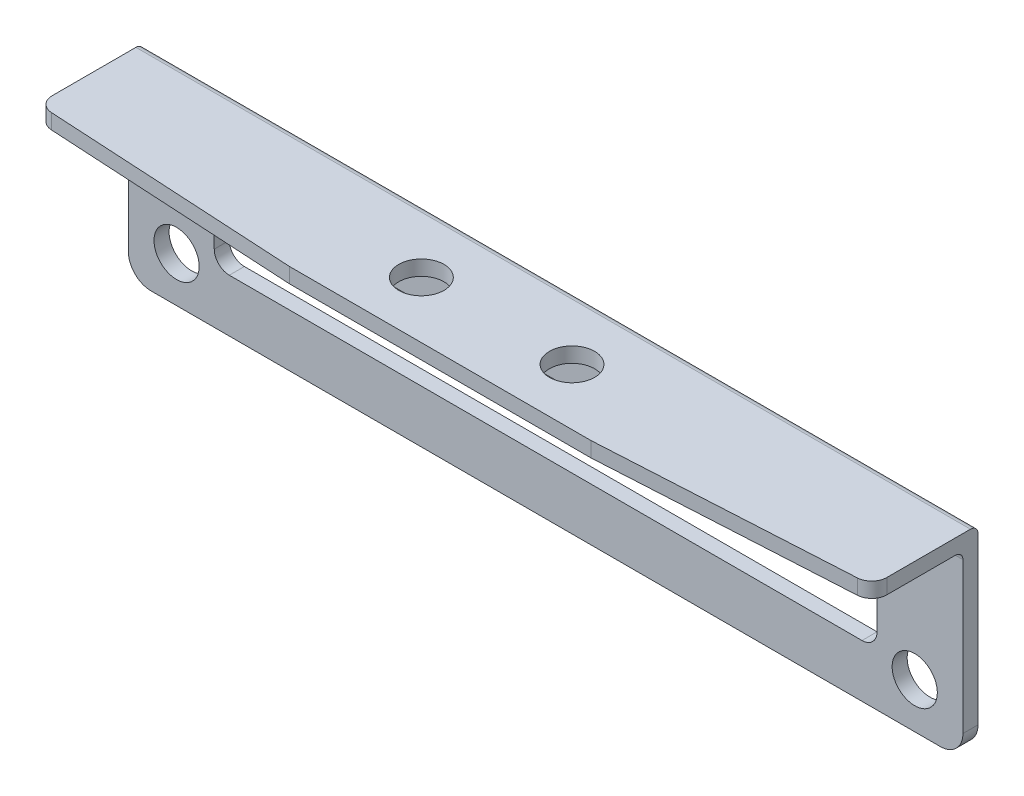
ISO-10303-21;
HEADER;
FILE_DESCRIPTION(('STEP AP214'),'2;1');
FILE_NAME('part.step','',(''),(''),'','','');
FILE_SCHEMA(('AUTOMOTIVE_DESIGN { 1 0 10303 214 1 1 1 1 }'));
ENDSEC;
DATA;
#1=APPLICATION_CONTEXT('core data for automotive mechanical design processes');
#2=APPLICATION_PROTOCOL_DEFINITION('international standard','automotive_design',2000,#1);
#3=PRODUCT_CONTEXT('',#1,'mechanical');
#4=PRODUCT('Part','Part','',(#3));
#5=PRODUCT_RELATED_PRODUCT_CATEGORY('part','',(#4));
#6=PRODUCT_DEFINITION_FORMATION('','',#4);
#7=PRODUCT_DEFINITION_CONTEXT('part definition',#1,'design');
#8=PRODUCT_DEFINITION('design','',#6,#7);
#9=PRODUCT_DEFINITION_SHAPE('','',#8);
#10=(LENGTH_UNIT() NAMED_UNIT(*) SI_UNIT(.MILLI.,.METRE.));
#11=(NAMED_UNIT(*) PLANE_ANGLE_UNIT() SI_UNIT($,.RADIAN.));
#12=(NAMED_UNIT(*) SI_UNIT($,.STERADIAN.) SOLID_ANGLE_UNIT());
#13=UNCERTAINTY_MEASURE_WITH_UNIT(LENGTH_MEASURE(1.E-05),#10,'distance_accuracy_value','');
#14=(GEOMETRIC_REPRESENTATION_CONTEXT(3) GLOBAL_UNCERTAINTY_ASSIGNED_CONTEXT((#13)) GLOBAL_UNIT_ASSIGNED_CONTEXT((#10,
#11,#12)) REPRESENTATION_CONTEXT('',''));
#15=CARTESIAN_POINT('',(0.,0.,0.));
#16=DIRECTION('',(0.,0.,1.));
#17=DIRECTION('',(1.,0.,0.));
#18=AXIS2_PLACEMENT_3D('',#15,#16,#17);
#19=CARTESIAN_POINT('',(0.,0.,1.));
#20=DIRECTION('',(0.,0.,1.));
#21=DIRECTION('',(1.,0.,0.));
#22=AXIS2_PLACEMENT_3D('',#19,#20,#21);
#23=PLANE('',#22);
#24=DIRECTION('',(1.,0.,0.));
#25=VECTOR('',#24,1.);
#26=CARTESIAN_POINT('',(-27.7,0.,1.));
#27=LINE('',#26,#25);
#28=CARTESIAN_POINT('',(-26.2,0.,1.));
#29=VERTEX_POINT('',#28);
#30=CARTESIAN_POINT('',(26.2,0.,1.));
#31=VERTEX_POINT('',#30);
#32=EDGE_CURVE('E252',#29,#31,#27,.T.);
#33=ORIENTED_EDGE('',*,*,#32,.T.);
#34=CARTESIAN_POINT('',(26.2,1.5,1.));
#35=DIRECTION('',(0.,0.,1.));
#36=DIRECTION('',(1.,0.,0.));
#37=AXIS2_PLACEMENT_3D('',#34,#35,#36);
#38=CIRCLE('',#37,1.5);
#39=CARTESIAN_POINT('',(27.7,1.5,1.));
#40=VERTEX_POINT('',#39);
#41=EDGE_CURVE('E367',#31,#40,#38,.T.);
#42=ORIENTED_EDGE('',*,*,#41,.T.);
#43=DIRECTION('',(0.,1.,0.));
#44=VECTOR('',#43,1.);
#45=CARTESIAN_POINT('',(27.7,0.,1.));
#46=LINE('',#45,#44);
#47=CARTESIAN_POINT('',(27.7,11.5,1.));
#48=VERTEX_POINT('',#47);
#49=EDGE_CURVE('E318',#40,#48,#46,.T.);
#50=ORIENTED_EDGE('',*,*,#49,.T.);
#51=DIRECTION('',(1.,0.,0.));
#52=VECTOR('',#51,1.);
#53=CARTESIAN_POINT('',(0.,11.5,1.));
#54=LINE('',#53,#52);
#55=CARTESIAN_POINT('',(-27.7,11.5,1.));
#56=VERTEX_POINT('',#55);
#57=EDGE_CURVE('E273',#48,#56,#54,.F.);
#58=ORIENTED_EDGE('',*,*,#57,.T.);
#59=DIRECTION('',(0.,-1.,0.));
#60=VECTOR('',#59,1.);
#61=CARTESIAN_POINT('',(-27.7,13.,1.));
#62=LINE('',#61,#60);
#63=CARTESIAN_POINT('',(-27.7,1.5,1.));
#64=VERTEX_POINT('',#63);
#65=EDGE_CURVE('E255',#56,#64,#62,.T.);
#66=ORIENTED_EDGE('',*,*,#65,.T.);
#67=CARTESIAN_POINT('',(-26.2,1.5,1.));
#68=DIRECTION('',(0.,0.,1.));
#69=DIRECTION('',(1.,0.,0.));
#70=AXIS2_PLACEMENT_3D('',#67,#68,#69);
#71=CIRCLE('',#70,1.5);
#72=EDGE_CURVE('E380',#64,#29,#71,.T.);
#73=ORIENTED_EDGE('',*,*,#72,.T.);
#74=EDGE_LOOP('',(#33,#42,#50,#58,#66,#73));
#75=FACE_BOUND('',#74,.T.);
#76=CARTESIAN_POINT('',(-24.5,3.,1.));
#77=DIRECTION('',(0.,0.,1.));
#78=DIRECTION('',(1.,0.,0.));
#79=AXIS2_PLACEMENT_3D('',#76,#77,#78);
#80=CIRCLE('',#79,1.5);
#81=CARTESIAN_POINT('',(-23.,3.,1.));
#82=VERTEX_POINT('',#81);
#83=EDGE_CURVE('E220',#82,#82,#80,.T.);
#84=ORIENTED_EDGE('',*,*,#83,.F.);
#85=EDGE_LOOP('',(#84));
#86=FACE_BOUND('',#85,.T.);
#87=DIRECTION('',(-1.,0.,0.));
#88=VECTOR('',#87,1.);
#89=CARTESIAN_POINT('',(-22.,8.3,1.));
#90=LINE('',#89,#88);
#91=CARTESIAN_POINT('',(21.,8.3,1.));
#92=VERTEX_POINT('',#91);
#93=CARTESIAN_POINT('',(-21.,8.3,1.));
#94=VERTEX_POINT('',#93);
#95=EDGE_CURVE('E229',#92,#94,#90,.T.);
#96=ORIENTED_EDGE('',*,*,#95,.F.);
#97=CARTESIAN_POINT('',(21.,7.3,1.));
#98=DIRECTION('',(0.,0.,1.));
#99=DIRECTION('',(1.,0.,0.));
#100=AXIS2_PLACEMENT_3D('',#97,#98,#99);
#101=CIRCLE('',#100,1.);
#102=CARTESIAN_POINT('',(22.,7.3,1.));
#103=VERTEX_POINT('',#102);
#104=EDGE_CURVE('E307',#92,#103,#101,.F.);
#105=ORIENTED_EDGE('',*,*,#104,.T.);
#106=DIRECTION('',(0.,1.,0.));
#107=VECTOR('',#106,1.);
#108=CARTESIAN_POINT('',(22.,8.3,1.));
#109=LINE('',#108,#107);
#110=CARTESIAN_POINT('',(22.,4.5,1.));
#111=VERTEX_POINT('',#110);
#112=EDGE_CURVE('E226',#111,#103,#109,.T.);
#113=ORIENTED_EDGE('',*,*,#112,.F.);
#114=CARTESIAN_POINT('',(21.,4.5,1.));
#115=DIRECTION('',(0.,0.,1.));
#116=DIRECTION('',(1.,0.,0.));
#117=AXIS2_PLACEMENT_3D('',#114,#115,#116);
#118=CIRCLE('',#117,1.);
#119=CARTESIAN_POINT('',(21.,3.5,1.));
#120=VERTEX_POINT('',#119);
#121=EDGE_CURVE('E303',#111,#120,#118,.F.);
#122=ORIENTED_EDGE('',*,*,#121,.T.);
#123=DIRECTION('',(1.,0.,0.));
#124=VECTOR('',#123,1.);
#125=CARTESIAN_POINT('',(-22.,3.5,1.));
#126=LINE('',#125,#124);
#127=CARTESIAN_POINT('',(-21.,3.5,1.));
#128=VERTEX_POINT('',#127);
#129=EDGE_CURVE('E236',#128,#120,#126,.T.);
#130=ORIENTED_EDGE('',*,*,#129,.F.);
#131=CARTESIAN_POINT('',(-21.,4.5,1.));
#132=DIRECTION('',(0.,0.,1.));
#133=DIRECTION('',(1.,0.,0.));
#134=AXIS2_PLACEMENT_3D('',#131,#132,#133);
#135=CIRCLE('',#134,1.);
#136=CARTESIAN_POINT('',(-22.,4.5,1.));
#137=VERTEX_POINT('',#136);
#138=EDGE_CURVE('E311',#128,#137,#135,.F.);
#139=ORIENTED_EDGE('',*,*,#138,.T.);
#140=DIRECTION('',(0.,-1.,0.));
#141=VECTOR('',#140,1.);
#142=CARTESIAN_POINT('',(-22.,8.3,1.));
#143=LINE('',#142,#141);
#144=CARTESIAN_POINT('',(-22.,7.3,1.));
#145=VERTEX_POINT('',#144);
#146=EDGE_CURVE('E233',#145,#137,#143,.T.);
#147=ORIENTED_EDGE('',*,*,#146,.F.);
#148=CARTESIAN_POINT('',(-21.,7.3,1.));
#149=DIRECTION('',(0.,0.,1.));
#150=DIRECTION('',(1.,0.,0.));
#151=AXIS2_PLACEMENT_3D('',#148,#149,#150);
#152=CIRCLE('',#151,1.);
#153=EDGE_CURVE('E315',#145,#94,#152,.F.);
#154=ORIENTED_EDGE('',*,*,#153,.T.);
#155=EDGE_LOOP('',(#96,#105,#113,#122,#130,#139,#147,#154));
#156=FACE_BOUND('',#155,.T.);
#157=CARTESIAN_POINT('',(24.5,3.,1.));
#158=DIRECTION('',(0.,0.,1.));
#159=DIRECTION('',(1.,0.,0.));
#160=AXIS2_PLACEMENT_3D('',#157,#158,#159);
#161=CIRCLE('',#160,1.5);
#162=CARTESIAN_POINT('',(26.,3.,1.));
#163=VERTEX_POINT('',#162);
#164=EDGE_CURVE('E213',#163,#163,#161,.T.);
#165=ORIENTED_EDGE('',*,*,#164,.F.);
#166=EDGE_LOOP('',(#165));
#167=FACE_BOUND('',#166,.T.);
#168=ADVANCED_FACE('F35',(#75,#86,#156,#167),#23,.T.);
#169=CARTESIAN_POINT('',(0.,0.,0.));
#170=DIRECTION('',(0.,0.,1.));
#171=DIRECTION('',(1.,0.,0.));
#172=AXIS2_PLACEMENT_3D('',#169,#170,#171);
#173=PLANE('',#172);
#174=CARTESIAN_POINT('',(-24.5,3.,0.));
#175=DIRECTION('',(0.,0.,1.));
#176=DIRECTION('',(1.,0.,0.));
#177=AXIS2_PLACEMENT_3D('',#174,#175,#176);
#178=CIRCLE('',#177,1.5);
#179=CARTESIAN_POINT('',(-23.,3.,0.));
#180=VERTEX_POINT('',#179);
#181=EDGE_CURVE('E216',#180,#180,#178,.T.);
#182=ORIENTED_EDGE('',*,*,#181,.T.);
#183=EDGE_LOOP('',(#182));
#184=FACE_BOUND('',#183,.T.);
#185=DIRECTION('',(0.,1.,0.));
#186=VECTOR('',#185,1.);
#187=CARTESIAN_POINT('',(27.7,0.,0.));
#188=LINE('',#187,#186);
#189=CARTESIAN_POINT('',(27.7,1.5,0.));
#190=VERTEX_POINT('',#189);
#191=CARTESIAN_POINT('',(27.7,12.5,0.));
#192=VERTEX_POINT('',#191);
#193=EDGE_CURVE('E259',#190,#192,#188,.T.);
#194=ORIENTED_EDGE('',*,*,#193,.F.);
#195=CARTESIAN_POINT('',(26.2,1.5,0.));
#196=DIRECTION('',(0.,0.,1.));
#197=DIRECTION('',(1.,0.,0.));
#198=AXIS2_PLACEMENT_3D('',#195,#196,#197);
#199=CIRCLE('',#198,1.5);
#200=CARTESIAN_POINT('',(26.2,0.,0.));
#201=VERTEX_POINT('',#200);
#202=EDGE_CURVE('E368',#190,#201,#199,.F.);
#203=ORIENTED_EDGE('',*,*,#202,.T.);
#204=DIRECTION('',(1.,0.,0.));
#205=VECTOR('',#204,1.);
#206=CARTESIAN_POINT('',(-27.7,0.,0.));
#207=LINE('',#206,#205);
#208=CARTESIAN_POINT('',(-26.2,0.,0.));
#209=VERTEX_POINT('',#208);
#210=EDGE_CURVE('E326',#209,#201,#207,.T.);
#211=ORIENTED_EDGE('',*,*,#210,.F.);
#212=CARTESIAN_POINT('',(-26.2,1.5,0.));
#213=DIRECTION('',(0.,0.,1.));
#214=DIRECTION('',(1.,0.,0.));
#215=AXIS2_PLACEMENT_3D('',#212,#213,#214);
#216=CIRCLE('',#215,1.5);
#217=CARTESIAN_POINT('',(-27.7,1.5,0.));
#218=VERTEX_POINT('',#217);
#219=EDGE_CURVE('E369',#209,#218,#216,.F.);
#220=ORIENTED_EDGE('',*,*,#219,.T.);
#221=DIRECTION('',(0.,-1.,0.));
#222=VECTOR('',#221,1.);
#223=CARTESIAN_POINT('',(-27.7,13.,0.));
#224=LINE('',#223,#222);
#225=CARTESIAN_POINT('',(-27.7,12.5,0.));
#226=VERTEX_POINT('',#225);
#227=EDGE_CURVE('E239',#226,#218,#224,.T.);
#228=ORIENTED_EDGE('',*,*,#227,.F.);
#229=DIRECTION('',(-1.,0.,0.));
#230=VECTOR('',#229,1.);
#231=CARTESIAN_POINT('',(0.,12.5,0.));
#232=LINE('',#231,#230);
#233=EDGE_CURVE('E264',#226,#192,#232,.F.);
#234=ORIENTED_EDGE('',*,*,#233,.T.);
#235=EDGE_LOOP('',(#194,#203,#211,#220,#228,#234));
#236=FACE_BOUND('',#235,.T.);
#237=DIRECTION('',(1.,0.,0.));
#238=VECTOR('',#237,1.);
#239=CARTESIAN_POINT('',(-22.,3.5,0.));
#240=LINE('',#239,#238);
#241=CARTESIAN_POINT('',(-21.,3.5,0.));
#242=VERTEX_POINT('',#241);
#243=CARTESIAN_POINT('',(21.,3.5,0.));
#244=VERTEX_POINT('',#243);
#245=EDGE_CURVE('E230',#242,#244,#240,.T.);
#246=ORIENTED_EDGE('',*,*,#245,.T.);
#247=CARTESIAN_POINT('',(21.,4.5,0.));
#248=DIRECTION('',(0.,0.,1.));
#249=DIRECTION('',(1.,0.,0.));
#250=AXIS2_PLACEMENT_3D('',#247,#248,#249);
#251=CIRCLE('',#250,1.);
#252=CARTESIAN_POINT('',(22.,4.5,0.));
#253=VERTEX_POINT('',#252);
#254=EDGE_CURVE('E301',#244,#253,#251,.T.);
#255=ORIENTED_EDGE('',*,*,#254,.T.);
#256=DIRECTION('',(0.,1.,0.));
#257=VECTOR('',#256,1.);
#258=CARTESIAN_POINT('',(22.,8.3,0.));
#259=LINE('',#258,#257);
#260=CARTESIAN_POINT('',(22.,7.3,0.));
#261=VERTEX_POINT('',#260);
#262=EDGE_CURVE('E223',#253,#261,#259,.T.);
#263=ORIENTED_EDGE('',*,*,#262,.T.);
#264=CARTESIAN_POINT('',(21.,7.3,0.));
#265=DIRECTION('',(0.,0.,1.));
#266=DIRECTION('',(1.,0.,0.));
#267=AXIS2_PLACEMENT_3D('',#264,#265,#266);
#268=CIRCLE('',#267,1.);
#269=CARTESIAN_POINT('',(21.,8.3,0.));
#270=VERTEX_POINT('',#269);
#271=EDGE_CURVE('E305',#261,#270,#268,.T.);
#272=ORIENTED_EDGE('',*,*,#271,.T.);
#273=DIRECTION('',(-1.,0.,0.));
#274=VECTOR('',#273,1.);
#275=CARTESIAN_POINT('',(-22.,8.3,0.));
#276=LINE('',#275,#274);
#277=CARTESIAN_POINT('',(-21.,8.3,0.));
#278=VERTEX_POINT('',#277);
#279=EDGE_CURVE('E242',#270,#278,#276,.T.);
#280=ORIENTED_EDGE('',*,*,#279,.T.);
#281=CARTESIAN_POINT('',(-21.,7.3,0.));
#282=DIRECTION('',(0.,0.,1.));
#283=DIRECTION('',(1.,0.,0.));
#284=AXIS2_PLACEMENT_3D('',#281,#282,#283);
#285=CIRCLE('',#284,1.);
#286=CARTESIAN_POINT('',(-22.,7.3,0.));
#287=VERTEX_POINT('',#286);
#288=EDGE_CURVE('E313',#278,#287,#285,.T.);
#289=ORIENTED_EDGE('',*,*,#288,.T.);
#290=DIRECTION('',(0.,-1.,0.));
#291=VECTOR('',#290,1.);
#292=CARTESIAN_POINT('',(-22.,8.3,0.));
#293=LINE('',#292,#291);
#294=CARTESIAN_POINT('',(-22.,4.5,0.));
#295=VERTEX_POINT('',#294);
#296=EDGE_CURVE('E245',#287,#295,#293,.T.);
#297=ORIENTED_EDGE('',*,*,#296,.T.);
#298=CARTESIAN_POINT('',(-21.,4.5,0.));
#299=DIRECTION('',(0.,0.,1.));
#300=DIRECTION('',(1.,0.,0.));
#301=AXIS2_PLACEMENT_3D('',#298,#299,#300);
#302=CIRCLE('',#301,1.);
#303=EDGE_CURVE('E309',#295,#242,#302,.T.);
#304=ORIENTED_EDGE('',*,*,#303,.T.);
#305=EDGE_LOOP('',(#246,#255,#263,#272,#280,#289,#297,#304));
#306=FACE_BOUND('',#305,.T.);
#307=CARTESIAN_POINT('',(24.5,3.,0.));
#308=DIRECTION('',(0.,0.,1.));
#309=DIRECTION('',(1.,0.,0.));
#310=AXIS2_PLACEMENT_3D('',#307,#308,#309);
#311=CIRCLE('',#310,1.5);
#312=CARTESIAN_POINT('',(26.,3.,0.));
#313=VERTEX_POINT('',#312);
#314=EDGE_CURVE('E217',#313,#313,#311,.T.);
#315=ORIENTED_EDGE('',*,*,#314,.T.);
#316=EDGE_LOOP('',(#315));
#317=FACE_BOUND('',#316,.T.);
#318=ADVANCED_FACE('F434',(#184,#236,#306,#317),#173,.F.);
#319=CARTESIAN_POINT('',(27.7,13.,1.));
#320=DIRECTION('',(0.,-1.,0.));
#321=DIRECTION('',(0.,0.,-1.));
#322=AXIS2_PLACEMENT_3D('',#319,#320,#321);
#323=PLANE('',#322);
#324=CARTESIAN_POINT('',(5.,13.,4.25));
#325=DIRECTION('',(0.,-1.,0.));
#326=DIRECTION('',(1.,0.,0.));
#327=AXIS2_PLACEMENT_3D('',#324,#325,#326);
#328=CIRCLE('',#327,1.5);
#329=CARTESIAN_POINT('',(6.5,13.,4.25));
#330=VERTEX_POINT('',#329);
#331=EDGE_CURVE('E399',#330,#330,#328,.T.);
#332=ORIENTED_EDGE('',*,*,#331,.T.);
#333=EDGE_LOOP('',(#332));
#334=FACE_BOUND('',#333,.T.);
#335=CARTESIAN_POINT('',(-5.,13.,4.25));
#336=DIRECTION('',(0.,-1.,0.));
#337=DIRECTION('',(1.,0.,0.));
#338=AXIS2_PLACEMENT_3D('',#335,#336,#337);
#339=CIRCLE('',#338,1.5);
#340=CARTESIAN_POINT('',(-3.5,13.,4.25));
#341=VERTEX_POINT('',#340);
#342=EDGE_CURVE('E199',#341,#341,#339,.T.);
#343=ORIENTED_EDGE('',*,*,#342,.T.);
#344=EDGE_LOOP('',(#343));
#345=FACE_BOUND('',#344,.T.);
#346=DIRECTION('',(0.,0.,-1.));
#347=VECTOR('',#346,1.);
#348=CARTESIAN_POINT('',(-27.7,13.,1.));
#349=LINE('',#348,#347);
#350=CARTESIAN_POINT('',(-27.7,13.,6.05490248126605));
#351=VERTEX_POINT('',#350);
#352=CARTESIAN_POINT('',(-27.7,13.,0.5));
#353=VERTEX_POINT('',#352);
#354=EDGE_CURVE('E331',#351,#353,#349,.T.);
#355=ORIENTED_EDGE('',*,*,#354,.F.);
#356=CARTESIAN_POINT('',(-26.7,13.,6.05490248126605));
#357=DIRECTION('',(0.,-1.,0.));
#358=DIRECTION('',(0.,0.,-1.));
#359=AXIS2_PLACEMENT_3D('',#356,#357,#358);
#360=CIRCLE('',#359,1.);
#361=CARTESIAN_POINT('',(-26.7564072228884,13.,7.05331032639049));
#362=VERTEX_POINT('',#361);
#363=EDGE_CURVE('E345',#351,#362,#360,.F.);
#364=ORIENTED_EDGE('',*,*,#363,.T.);
#365=DIRECTION('',(0.998407845124436,0.,0.0564072228883862));
#366=VECTOR('',#365,1.);
#367=CARTESIAN_POINT('',(-10.,13.,8.));
#368=LINE('',#367,#366);
#369=CARTESIAN_POINT('',(-10.,13.,8.));
#370=VERTEX_POINT('',#369);
#371=EDGE_CURVE('E389',#362,#370,#368,.T.);
#372=ORIENTED_EDGE('',*,*,#371,.T.);
#373=DIRECTION('',(-1.,0.,0.));
#374=VECTOR('',#373,1.);
#375=CARTESIAN_POINT('',(27.7,13.,8.));
#376=LINE('',#375,#374);
#377=CARTESIAN_POINT('',(10.,13.,8.));
#378=VERTEX_POINT('',#377);
#379=EDGE_CURVE('E206',#378,#370,#376,.T.);
#380=ORIENTED_EDGE('',*,*,#379,.F.);
#381=DIRECTION('',(0.998407845124436,0.,-0.0564072228883863));
#382=VECTOR('',#381,1.);
#383=CARTESIAN_POINT('',(10.,13.,8.));
#384=LINE('',#383,#382);
#385=CARTESIAN_POINT('',(26.7564072228884,13.,7.05331032639049));
#386=VERTEX_POINT('',#385);
#387=EDGE_CURVE('E185',#378,#386,#384,.T.);
#388=ORIENTED_EDGE('',*,*,#387,.T.);
#389=CARTESIAN_POINT('',(26.7,13.,6.05490248126605));
#390=DIRECTION('',(0.,-1.,0.));
#391=DIRECTION('',(0.,0.,-1.));
#392=AXIS2_PLACEMENT_3D('',#389,#390,#391);
#393=CIRCLE('',#392,1.);
#394=CARTESIAN_POINT('',(27.7,13.,6.05490248126605));
#395=VERTEX_POINT('',#394);
#396=EDGE_CURVE('E55',#386,#395,#393,.F.);
#397=ORIENTED_EDGE('',*,*,#396,.T.);
#398=DIRECTION('',(0.,0.,-1.));
#399=VECTOR('',#398,1.);
#400=CARTESIAN_POINT('',(27.7,13.,1.));
#401=LINE('',#400,#399);
#402=CARTESIAN_POINT('',(27.7,13.,0.5));
#403=VERTEX_POINT('',#402);
#404=EDGE_CURVE('E320',#395,#403,#401,.T.);
#405=ORIENTED_EDGE('',*,*,#404,.T.);
#406=DIRECTION('',(-1.,0.,0.));
#407=VECTOR('',#406,1.);
#408=CARTESIAN_POINT('',(27.7,13.,0.5));
#409=LINE('',#408,#407);
#410=EDGE_CURVE('E260',#403,#353,#409,.T.);
#411=ORIENTED_EDGE('',*,*,#410,.T.);
#412=EDGE_LOOP('',(#355,#364,#372,#380,#388,#397,#405,#411));
#413=FACE_BOUND('',#412,.T.);
#414=ADVANCED_FACE('F408',(#334,#345,#413),#323,.F.);
#415=CARTESIAN_POINT('',(-27.7,13.,1.));
#416=DIRECTION('',(1.,0.,0.));
#417=DIRECTION('',(0.,1.,0.));
#418=AXIS2_PLACEMENT_3D('',#415,#416,#417);
#419=PLANE('',#418);
#420=DIRECTION('',(0.,0.,-1.));
#421=VECTOR('',#420,1.);
#422=CARTESIAN_POINT('',(-27.7,12.,8.));
#423=LINE('',#422,#421);
#424=CARTESIAN_POINT('',(-27.7,12.,6.05490248126605));
#425=VERTEX_POINT('',#424);
#426=CARTESIAN_POINT('',(-27.7,12.,1.5));
#427=VERTEX_POINT('',#426);
#428=EDGE_CURVE('E208',#425,#427,#423,.T.);
#429=ORIENTED_EDGE('',*,*,#428,.F.);
#430=DIRECTION('',(0.,-1.,0.));
#431=VECTOR('',#430,1.);
#432=CARTESIAN_POINT('',(-27.7,13.,6.05490248126605));
#433=LINE('',#432,#431);
#434=EDGE_CURVE('E342',#425,#351,#433,.F.);
#435=ORIENTED_EDGE('',*,*,#434,.T.);
#436=ORIENTED_EDGE('',*,*,#354,.T.);
#437=CARTESIAN_POINT('',(-27.7,12.5,0.5));
#438=DIRECTION('',(1.,0.,0.));
#439=DIRECTION('',(0.,1.,0.));
#440=AXIS2_PLACEMENT_3D('',#437,#438,#439);
#441=CIRCLE('',#440,0.5);
#442=EDGE_CURVE('E262',#353,#226,#441,.F.);
#443=ORIENTED_EDGE('',*,*,#442,.T.);
#444=ORIENTED_EDGE('',*,*,#227,.T.);
#445=DIRECTION('',(0.,0.,-1.));
#446=VECTOR('',#445,1.);
#447=CARTESIAN_POINT('',(-27.7,1.5,1.));
#448=LINE('',#447,#446);
#449=EDGE_CURVE('E383',#218,#64,#448,.F.);
#450=ORIENTED_EDGE('',*,*,#449,.T.);
#451=ORIENTED_EDGE('',*,*,#65,.F.);
#452=CARTESIAN_POINT('',(-27.7,11.5,1.5));
#453=DIRECTION('',(1.,0.,0.));
#454=DIRECTION('',(0.,1.,0.));
#455=AXIS2_PLACEMENT_3D('',#452,#453,#454);
#456=CIRCLE('',#455,0.5);
#457=EDGE_CURVE('E278',#56,#427,#456,.T.);
#458=ORIENTED_EDGE('',*,*,#457,.T.);
#459=EDGE_LOOP('',(#429,#435,#436,#443,#444,#450,#451,#458));
#460=FACE_BOUND('',#459,.T.);
#461=ADVANCED_FACE('F452',(#460),#419,.F.);
#462=CARTESIAN_POINT('',(-27.7,0.,1.));
#463=DIRECTION('',(0.,1.,0.));
#464=DIRECTION('',(0.,0.,1.));
#465=AXIS2_PLACEMENT_3D('',#462,#463,#464);
#466=PLANE('',#465);
#467=ORIENTED_EDGE('',*,*,#210,.T.);
#468=DIRECTION('',(0.,0.,-1.));
#469=VECTOR('',#468,1.);
#470=CARTESIAN_POINT('',(26.2,0.,1.));
#471=LINE('',#470,#469);
#472=EDGE_CURVE('E378',#201,#31,#471,.F.);
#473=ORIENTED_EDGE('',*,*,#472,.T.);
#474=ORIENTED_EDGE('',*,*,#32,.F.);
#475=DIRECTION('',(0.,0.,-1.));
#476=VECTOR('',#475,1.);
#477=CARTESIAN_POINT('',(-26.2,0.,1.));
#478=LINE('',#477,#476);
#479=EDGE_CURVE('E373',#29,#209,#478,.T.);
#480=ORIENTED_EDGE('',*,*,#479,.T.);
#481=EDGE_LOOP('',(#467,#473,#474,#480));
#482=FACE_BOUND('',#481,.T.);
#483=ADVANCED_FACE('F449',(#482),#466,.F.);
#484=CARTESIAN_POINT('',(27.7,0.,1.));
#485=DIRECTION('',(-1.,0.,0.));
#486=DIRECTION('',(0.,-1.,0.));
#487=AXIS2_PLACEMENT_3D('',#484,#485,#486);
#488=PLANE('',#487);
#489=ORIENTED_EDGE('',*,*,#404,.F.);
#490=DIRECTION('',(0.,-1.,0.));
#491=VECTOR('',#490,1.);
#492=CARTESIAN_POINT('',(27.7,0.,6.05490248126605));
#493=LINE('',#492,#491);
#494=CARTESIAN_POINT('',(27.7,12.,6.05490248126605));
#495=VERTEX_POINT('',#494);
#496=EDGE_CURVE('E43',#395,#495,#493,.T.);
#497=ORIENTED_EDGE('',*,*,#496,.T.);
#498=DIRECTION('',(0.,0.,-1.));
#499=VECTOR('',#498,1.);
#500=CARTESIAN_POINT('',(27.7,12.,8.));
#501=LINE('',#500,#499);
#502=CARTESIAN_POINT('',(27.7,12.,1.5));
#503=VERTEX_POINT('',#502);
#504=EDGE_CURVE('E205',#495,#503,#501,.T.);
#505=ORIENTED_EDGE('',*,*,#504,.T.);
#506=CARTESIAN_POINT('',(27.7,11.5,1.5));
#507=DIRECTION('',(-1.,0.,0.));
#508=DIRECTION('',(0.,-1.,0.));
#509=AXIS2_PLACEMENT_3D('',#506,#507,#508);
#510=CIRCLE('',#509,0.5);
#511=EDGE_CURVE('E275',#503,#48,#510,.T.);
#512=ORIENTED_EDGE('',*,*,#511,.T.);
#513=ORIENTED_EDGE('',*,*,#49,.F.);
#514=DIRECTION('',(0.,0.,-1.));
#515=VECTOR('',#514,1.);
#516=CARTESIAN_POINT('',(27.7,1.5,1.));
#517=LINE('',#516,#515);
#518=EDGE_CURVE('E317',#40,#190,#517,.T.);
#519=ORIENTED_EDGE('',*,*,#518,.T.);
#520=ORIENTED_EDGE('',*,*,#193,.T.);
#521=CARTESIAN_POINT('',(27.7,12.5,0.5));
#522=DIRECTION('',(-1.,0.,0.));
#523=DIRECTION('',(0.,-1.,0.));
#524=AXIS2_PLACEMENT_3D('',#521,#522,#523);
#525=CIRCLE('',#524,0.5);
#526=EDGE_CURVE('E267',#192,#403,#525,.F.);
#527=ORIENTED_EDGE('',*,*,#526,.T.);
#528=EDGE_LOOP('',(#489,#497,#505,#512,#513,#519,#520,#527));
#529=FACE_BOUND('',#528,.T.);
#530=ADVANCED_FACE('F349',(#529),#488,.F.);
#531=CARTESIAN_POINT('',(22.,8.3,1.));
#532=DIRECTION('',(-1.,0.,0.));
#533=DIRECTION('',(0.,0.,1.));
#534=AXIS2_PLACEMENT_3D('',#531,#532,#533);
#535=PLANE('',#534);
#536=ORIENTED_EDGE('',*,*,#262,.F.);
#537=DIRECTION('',(0.,0.,-1.));
#538=VECTOR('',#537,1.);
#539=CARTESIAN_POINT('',(22.,4.5,1.));
#540=LINE('',#539,#538);
#541=EDGE_CURVE('E289',#253,#111,#540,.F.);
#542=ORIENTED_EDGE('',*,*,#541,.T.);
#543=ORIENTED_EDGE('',*,*,#112,.T.);
#544=DIRECTION('',(0.,0.,-1.));
#545=VECTOR('',#544,1.);
#546=CARTESIAN_POINT('',(22.,7.3,0.));
#547=LINE('',#546,#545);
#548=EDGE_CURVE('E286',#103,#261,#547,.T.);
#549=ORIENTED_EDGE('',*,*,#548,.T.);
#550=EDGE_LOOP('',(#536,#542,#543,#549));
#551=FACE_BOUND('',#550,.T.);
#552=ADVANCED_FACE('F444',(#551),#535,.T.);
#553=CARTESIAN_POINT('',(-22.,8.3,1.));
#554=DIRECTION('',(0.,-1.,0.));
#555=DIRECTION('',(0.,0.,-1.));
#556=AXIS2_PLACEMENT_3D('',#553,#554,#555);
#557=PLANE('',#556);
#558=ORIENTED_EDGE('',*,*,#279,.F.);
#559=DIRECTION('',(0.,0.,-1.));
#560=VECTOR('',#559,1.);
#561=CARTESIAN_POINT('',(21.,8.3,1.));
#562=LINE('',#561,#560);
#563=EDGE_CURVE('E294',#270,#92,#562,.F.);
#564=ORIENTED_EDGE('',*,*,#563,.T.);
#565=ORIENTED_EDGE('',*,*,#95,.T.);
#566=DIRECTION('',(0.,0.,-1.));
#567=VECTOR('',#566,1.);
#568=CARTESIAN_POINT('',(-21.,8.3,0.));
#569=LINE('',#568,#567);
#570=EDGE_CURVE('E291',#94,#278,#569,.T.);
#571=ORIENTED_EDGE('',*,*,#570,.T.);
#572=EDGE_LOOP('',(#558,#564,#565,#571));
#573=FACE_BOUND('',#572,.T.);
#574=ADVANCED_FACE('F524',(#573),#557,.T.);
#575=CARTESIAN_POINT('',(-22.,8.3,1.));
#576=DIRECTION('',(1.,0.,0.));
#577=DIRECTION('',(0.,1.,0.));
#578=AXIS2_PLACEMENT_3D('',#575,#576,#577);
#579=PLANE('',#578);
#580=ORIENTED_EDGE('',*,*,#146,.T.);
#581=DIRECTION('',(0.,0.,-1.));
#582=VECTOR('',#581,1.);
#583=CARTESIAN_POINT('',(-22.,4.5,0.));
#584=LINE('',#583,#582);
#585=EDGE_CURVE('E298',#137,#295,#584,.T.);
#586=ORIENTED_EDGE('',*,*,#585,.T.);
#587=ORIENTED_EDGE('',*,*,#296,.F.);
#588=DIRECTION('',(0.,0.,-1.));
#589=VECTOR('',#588,1.);
#590=CARTESIAN_POINT('',(-22.,7.3,1.));
#591=LINE('',#590,#589);
#592=EDGE_CURVE('E296',#287,#145,#591,.F.);
#593=ORIENTED_EDGE('',*,*,#592,.T.);
#594=EDGE_LOOP('',(#580,#586,#587,#593));
#595=FACE_BOUND('',#594,.T.);
#596=ADVANCED_FACE('F521',(#595),#579,.T.);
#597=CARTESIAN_POINT('',(-22.,3.5,1.));
#598=DIRECTION('',(0.,1.,0.));
#599=DIRECTION('',(-1.,0.,0.));
#600=AXIS2_PLACEMENT_3D('',#597,#598,#599);
#601=PLANE('',#600);
#602=ORIENTED_EDGE('',*,*,#129,.T.);
#603=DIRECTION('',(0.,0.,-1.));
#604=VECTOR('',#603,1.);
#605=CARTESIAN_POINT('',(21.,3.5,0.));
#606=LINE('',#605,#604);
#607=EDGE_CURVE('E283',#120,#244,#606,.T.);
#608=ORIENTED_EDGE('',*,*,#607,.T.);
#609=ORIENTED_EDGE('',*,*,#245,.F.);
#610=DIRECTION('',(0.,0.,-1.));
#611=VECTOR('',#610,1.);
#612=CARTESIAN_POINT('',(-21.,3.5,1.));
#613=LINE('',#612,#611);
#614=EDGE_CURVE('E281',#242,#128,#613,.F.);
#615=ORIENTED_EDGE('',*,*,#614,.T.);
#616=EDGE_LOOP('',(#602,#608,#609,#615));
#617=FACE_BOUND('',#616,.T.);
#618=ADVANCED_FACE('F514',(#617),#601,.T.);
#619=CARTESIAN_POINT('',(-24.5,3.,1.));
#620=DIRECTION('',(0.,0.,-1.));
#621=DIRECTION('',(-1.,0.,0.));
#622=AXIS2_PLACEMENT_3D('',#619,#620,#621);
#623=CYLINDRICAL_SURFACE('',#622,1.5);
#624=ORIENTED_EDGE('',*,*,#83,.T.);
#625=EDGE_LOOP('',(#624));
#626=FACE_BOUND('',#625,.T.);
#627=ORIENTED_EDGE('',*,*,#181,.F.);
#628=EDGE_LOOP('',(#627));
#629=FACE_BOUND('',#628,.T.);
#630=ADVANCED_FACE('F508',(#626,#629),#623,.F.);
#631=CARTESIAN_POINT('',(24.5,3.,1.));
#632=DIRECTION('',(0.,0.,-1.));
#633=DIRECTION('',(-1.,0.,0.));
#634=AXIS2_PLACEMENT_3D('',#631,#632,#633);
#635=CYLINDRICAL_SURFACE('',#634,1.5);
#636=ORIENTED_EDGE('',*,*,#164,.T.);
#637=EDGE_LOOP('',(#636));
#638=FACE_BOUND('',#637,.T.);
#639=ORIENTED_EDGE('',*,*,#314,.F.);
#640=EDGE_LOOP('',(#639));
#641=FACE_BOUND('',#640,.T.);
#642=ADVANCED_FACE('F421',(#638,#641),#635,.F.);
#643=CARTESIAN_POINT('',(27.7,12.,8.));
#644=DIRECTION('',(0.,1.,0.));
#645=DIRECTION('',(-1.,0.,0.));
#646=AXIS2_PLACEMENT_3D('',#643,#644,#645);
#647=PLANE('',#646);
#648=CARTESIAN_POINT('',(5.,12.,4.25));
#649=DIRECTION('',(0.,-1.,0.));
#650=DIRECTION('',(1.,0.,0.));
#651=AXIS2_PLACEMENT_3D('',#648,#649,#650);
#652=CIRCLE('',#651,1.5);
#653=CARTESIAN_POINT('',(6.5,12.,4.25));
#654=VERTEX_POINT('',#653);
#655=EDGE_CURVE('E402',#654,#654,#652,.T.);
#656=ORIENTED_EDGE('',*,*,#655,.F.);
#657=EDGE_LOOP('',(#656));
#658=FACE_BOUND('',#657,.T.);
#659=CARTESIAN_POINT('',(-5.,12.,4.25));
#660=DIRECTION('',(0.,-1.,0.));
#661=DIRECTION('',(1.,0.,0.));
#662=AXIS2_PLACEMENT_3D('',#659,#660,#661);
#663=CIRCLE('',#662,1.5);
#664=CARTESIAN_POINT('',(-3.5,12.,4.25));
#665=VERTEX_POINT('',#664);
#666=EDGE_CURVE('E396',#665,#665,#663,.T.);
#667=ORIENTED_EDGE('',*,*,#666,.F.);
#668=EDGE_LOOP('',(#667));
#669=FACE_BOUND('',#668,.T.);
#670=DIRECTION('',(0.998407845124436,0.,0.0564072228883862));
#671=VECTOR('',#670,1.);
#672=CARTESIAN_POINT('',(-10.,12.,8.));
#673=LINE('',#672,#671);
#674=CARTESIAN_POINT('',(-26.7564072228884,12.,7.05331032639049));
#675=VERTEX_POINT('',#674);
#676=CARTESIAN_POINT('',(-10.,12.,8.));
#677=VERTEX_POINT('',#676);
#678=EDGE_CURVE('E190',#675,#677,#673,.T.);
#679=ORIENTED_EDGE('',*,*,#678,.F.);
#680=CARTESIAN_POINT('',(-26.7,12.,6.05490248126605));
#681=DIRECTION('',(0.,1.,0.));
#682=DIRECTION('',(-1.,0.,0.));
#683=AXIS2_PLACEMENT_3D('',#680,#681,#682);
#684=CIRCLE('',#683,1.);
#685=EDGE_CURVE('E339',#675,#425,#684,.F.);
#686=ORIENTED_EDGE('',*,*,#685,.T.);
#687=ORIENTED_EDGE('',*,*,#428,.T.);
#688=DIRECTION('',(1.,0.,0.));
#689=VECTOR('',#688,1.);
#690=CARTESIAN_POINT('',(27.7,12.,1.5));
#691=LINE('',#690,#689);
#692=EDGE_CURVE('E270',#427,#503,#691,.T.);
#693=ORIENTED_EDGE('',*,*,#692,.T.);
#694=ORIENTED_EDGE('',*,*,#504,.F.);
#695=CARTESIAN_POINT('',(26.7,12.,6.05490248126605));
#696=DIRECTION('',(0.,1.,0.));
#697=DIRECTION('',(-1.,0.,0.));
#698=AXIS2_PLACEMENT_3D('',#695,#696,#697);
#699=CIRCLE('',#698,1.);
#700=CARTESIAN_POINT('',(26.7564072228884,12.,7.05331032639049));
#701=VERTEX_POINT('',#700);
#702=EDGE_CURVE('E198',#495,#701,#699,.F.);
#703=ORIENTED_EDGE('',*,*,#702,.T.);
#704=DIRECTION('',(0.998407845124436,0.,-0.0564072228883863));
#705=VECTOR('',#704,1.);
#706=CARTESIAN_POINT('',(10.,12.,8.));
#707=LINE('',#706,#705);
#708=CARTESIAN_POINT('',(10.,12.,8.));
#709=VERTEX_POINT('',#708);
#710=EDGE_CURVE('E184',#709,#701,#707,.T.);
#711=ORIENTED_EDGE('',*,*,#710,.F.);
#712=DIRECTION('',(1.,0.,0.));
#713=VECTOR('',#712,1.);
#714=CARTESIAN_POINT('',(27.7,12.,8.));
#715=LINE('',#714,#713);
#716=EDGE_CURVE('E196',#677,#709,#715,.T.);
#717=ORIENTED_EDGE('',*,*,#716,.F.);
#718=EDGE_LOOP('',(#679,#686,#687,#693,#694,#703,#711,#717));
#719=FACE_BOUND('',#718,.T.);
#720=ADVANCED_FACE('F195',(#658,#669,#719),#647,.F.);
#721=CARTESIAN_POINT('',(0.,0.,8.));
#722=DIRECTION('',(0.,0.,-1.));
#723=DIRECTION('',(-1.,0.,0.));
#724=AXIS2_PLACEMENT_3D('',#721,#722,#723);
#725=PLANE('',#724);
#726=ORIENTED_EDGE('',*,*,#716,.T.);
#727=DIRECTION('',(0.,-1.,0.));
#728=VECTOR('',#727,1.);
#729=CARTESIAN_POINT('',(10.,13.,8.));
#730=LINE('',#729,#728);
#731=EDGE_CURVE('E181',#378,#709,#730,.T.);
#732=ORIENTED_EDGE('',*,*,#731,.F.);
#733=ORIENTED_EDGE('',*,*,#379,.T.);
#734=DIRECTION('',(0.,-1.,0.));
#735=VECTOR('',#734,1.);
#736=CARTESIAN_POINT('',(-10.,13.,8.));
#737=LINE('',#736,#735);
#738=EDGE_CURVE('E204',#370,#677,#737,.T.);
#739=ORIENTED_EDGE('',*,*,#738,.T.);
#740=EDGE_LOOP('',(#726,#732,#733,#739));
#741=FACE_BOUND('',#740,.T.);
#742=ADVANCED_FACE('F202',(#741),#725,.F.);
#743=CARTESIAN_POINT('',(-10.,13.,8.));
#744=DIRECTION('',(0.0564072228883862,0.,-0.998407845124436));
#745=DIRECTION('',(-0.998407845124436,0.,-0.0564072228883862));
#746=AXIS2_PLACEMENT_3D('',#743,#744,#745);
#747=PLANE('',#746);
#748=ORIENTED_EDGE('',*,*,#371,.F.);
#749=DIRECTION('',(0.,-1.,0.));
#750=VECTOR('',#749,1.);
#751=CARTESIAN_POINT('',(-26.7564072228884,13.,7.05331032639049));
#752=LINE('',#751,#750);
#753=EDGE_CURVE('E340',#362,#675,#752,.T.);
#754=ORIENTED_EDGE('',*,*,#753,.T.);
#755=ORIENTED_EDGE('',*,*,#678,.T.);
#756=ORIENTED_EDGE('',*,*,#738,.F.);
#757=EDGE_LOOP('',(#748,#754,#755,#756));
#758=FACE_BOUND('',#757,.T.);
#759=ADVANCED_FACE('F388',(#758),#747,.F.);
#760=CARTESIAN_POINT('',(10.,13.,8.));
#761=DIRECTION('',(-0.0564072228883863,0.,-0.998407845124436));
#762=DIRECTION('',(-0.998407845124436,0.,0.0564072228883863));
#763=AXIS2_PLACEMENT_3D('',#760,#761,#762);
#764=PLANE('',#763);
#765=ORIENTED_EDGE('',*,*,#710,.T.);
#766=DIRECTION('',(0.,-1.,0.));
#767=VECTOR('',#766,1.);
#768=CARTESIAN_POINT('',(26.7564072228884,13.,7.05331032639049));
#769=LINE('',#768,#767);
#770=EDGE_CURVE('E11',#701,#386,#769,.F.);
#771=ORIENTED_EDGE('',*,*,#770,.T.);
#772=ORIENTED_EDGE('',*,*,#387,.F.);
#773=ORIENTED_EDGE('',*,*,#731,.T.);
#774=EDGE_LOOP('',(#765,#771,#772,#773));
#775=FACE_BOUND('',#774,.T.);
#776=ADVANCED_FACE('F183',(#775),#764,.F.);
#777=CARTESIAN_POINT('',(-5.,13.,4.25));
#778=DIRECTION('',(0.,-1.,0.));
#779=DIRECTION('',(1.,0.,0.));
#780=AXIS2_PLACEMENT_3D('',#777,#778,#779);
#781=CYLINDRICAL_SURFACE('',#780,1.5);
#782=ORIENTED_EDGE('',*,*,#342,.F.);
#783=EDGE_LOOP('',(#782));
#784=FACE_BOUND('',#783,.T.);
#785=ORIENTED_EDGE('',*,*,#666,.T.);
#786=EDGE_LOOP('',(#785));
#787=FACE_BOUND('',#786,.T.);
#788=ADVANCED_FACE('F415',(#784,#787),#781,.F.);
#789=CARTESIAN_POINT('',(5.,13.,4.25));
#790=DIRECTION('',(0.,-1.,0.));
#791=DIRECTION('',(1.,0.,0.));
#792=AXIS2_PLACEMENT_3D('',#789,#790,#791);
#793=CYLINDRICAL_SURFACE('',#792,1.5);
#794=ORIENTED_EDGE('',*,*,#331,.F.);
#795=EDGE_LOOP('',(#794));
#796=FACE_BOUND('',#795,.T.);
#797=ORIENTED_EDGE('',*,*,#655,.T.);
#798=EDGE_LOOP('',(#797));
#799=FACE_BOUND('',#798,.T.);
#800=ADVANCED_FACE('F411',(#796,#799),#793,.F.);
#801=CARTESIAN_POINT('',(27.7,12.5,0.5));
#802=DIRECTION('',(-1.,0.,0.));
#803=DIRECTION('',(0.,0.,1.));
#804=AXIS2_PLACEMENT_3D('',#801,#802,#803);
#805=CYLINDRICAL_SURFACE('',#804,0.5);
#806=ORIENTED_EDGE('',*,*,#526,.F.);
#807=ORIENTED_EDGE('',*,*,#233,.F.);
#808=ORIENTED_EDGE('',*,*,#442,.F.);
#809=ORIENTED_EDGE('',*,*,#410,.F.);
#810=EDGE_LOOP('',(#806,#807,#808,#809));
#811=FACE_BOUND('',#810,.T.);
#812=ADVANCED_FACE('F414',(#811),#805,.T.);
#813=CARTESIAN_POINT('',(27.7,11.5,1.5));
#814=DIRECTION('',(1.,0.,0.));
#815=DIRECTION('',(0.,1.,0.));
#816=AXIS2_PLACEMENT_3D('',#813,#814,#815);
#817=CYLINDRICAL_SURFACE('',#816,0.5);
#818=ORIENTED_EDGE('',*,*,#457,.F.);
#819=ORIENTED_EDGE('',*,*,#57,.F.);
#820=ORIENTED_EDGE('',*,*,#511,.F.);
#821=ORIENTED_EDGE('',*,*,#692,.F.);
#822=EDGE_LOOP('',(#818,#819,#820,#821));
#823=FACE_BOUND('',#822,.T.);
#824=ADVANCED_FACE('F356',(#823),#817,.F.);
#825=CARTESIAN_POINT('',(21.,4.5,1.));
#826=DIRECTION('',(0.,0.,1.));
#827=DIRECTION('',(1.,0.,0.));
#828=AXIS2_PLACEMENT_3D('',#825,#826,#827);
#829=CYLINDRICAL_SURFACE('',#828,1.);
#830=ORIENTED_EDGE('',*,*,#121,.F.);
#831=ORIENTED_EDGE('',*,*,#541,.F.);
#832=ORIENTED_EDGE('',*,*,#254,.F.);
#833=ORIENTED_EDGE('',*,*,#607,.F.);
#834=EDGE_LOOP('',(#830,#831,#832,#833));
#835=FACE_BOUND('',#834,.T.);
#836=ADVANCED_FACE('F464',(#835),#829,.F.);
#837=CARTESIAN_POINT('',(21.,7.3,1.));
#838=DIRECTION('',(0.,0.,1.));
#839=DIRECTION('',(1.,0.,0.));
#840=AXIS2_PLACEMENT_3D('',#837,#838,#839);
#841=CYLINDRICAL_SURFACE('',#840,1.);
#842=ORIENTED_EDGE('',*,*,#104,.F.);
#843=ORIENTED_EDGE('',*,*,#563,.F.);
#844=ORIENTED_EDGE('',*,*,#271,.F.);
#845=ORIENTED_EDGE('',*,*,#548,.F.);
#846=EDGE_LOOP('',(#842,#843,#844,#845));
#847=FACE_BOUND('',#846,.T.);
#848=ADVANCED_FACE('F467',(#847),#841,.F.);
#849=CARTESIAN_POINT('',(-21.,4.5,1.));
#850=DIRECTION('',(0.,0.,1.));
#851=DIRECTION('',(1.,0.,0.));
#852=AXIS2_PLACEMENT_3D('',#849,#850,#851);
#853=CYLINDRICAL_SURFACE('',#852,1.);
#854=ORIENTED_EDGE('',*,*,#138,.F.);
#855=ORIENTED_EDGE('',*,*,#614,.F.);
#856=ORIENTED_EDGE('',*,*,#303,.F.);
#857=ORIENTED_EDGE('',*,*,#585,.F.);
#858=EDGE_LOOP('',(#854,#855,#856,#857));
#859=FACE_BOUND('',#858,.T.);
#860=ADVANCED_FACE('F471',(#859),#853,.F.);
#861=CARTESIAN_POINT('',(-21.,7.3,1.));
#862=DIRECTION('',(0.,0.,1.));
#863=DIRECTION('',(1.,0.,0.));
#864=AXIS2_PLACEMENT_3D('',#861,#862,#863);
#865=CYLINDRICAL_SURFACE('',#864,1.);
#866=ORIENTED_EDGE('',*,*,#153,.F.);
#867=ORIENTED_EDGE('',*,*,#592,.F.);
#868=ORIENTED_EDGE('',*,*,#288,.F.);
#869=ORIENTED_EDGE('',*,*,#570,.F.);
#870=EDGE_LOOP('',(#866,#867,#868,#869));
#871=FACE_BOUND('',#870,.T.);
#872=ADVANCED_FACE('F475',(#871),#865,.F.);
#873=CARTESIAN_POINT('',(26.2,1.5,1.));
#874=DIRECTION('',(0.,0.,-1.));
#875=DIRECTION('',(-1.,0.,0.));
#876=AXIS2_PLACEMENT_3D('',#873,#874,#875);
#877=CYLINDRICAL_SURFACE('',#876,1.5);
#878=ORIENTED_EDGE('',*,*,#41,.F.);
#879=ORIENTED_EDGE('',*,*,#472,.F.);
#880=ORIENTED_EDGE('',*,*,#202,.F.);
#881=ORIENTED_EDGE('',*,*,#518,.F.);
#882=EDGE_LOOP('',(#878,#879,#880,#881));
#883=FACE_BOUND('',#882,.T.);
#884=ADVANCED_FACE('F365',(#883),#877,.T.);
#885=CARTESIAN_POINT('',(-26.2,1.5,1.));
#886=DIRECTION('',(0.,0.,-1.));
#887=DIRECTION('',(-1.,0.,0.));
#888=AXIS2_PLACEMENT_3D('',#885,#886,#887);
#889=CYLINDRICAL_SURFACE('',#888,1.5);
#890=ORIENTED_EDGE('',*,*,#72,.F.);
#891=ORIENTED_EDGE('',*,*,#449,.F.);
#892=ORIENTED_EDGE('',*,*,#219,.F.);
#893=ORIENTED_EDGE('',*,*,#479,.F.);
#894=EDGE_LOOP('',(#890,#891,#892,#893));
#895=FACE_BOUND('',#894,.T.);
#896=ADVANCED_FACE('F482',(#895),#889,.T.);
#897=CARTESIAN_POINT('',(-26.7,13.,6.05490248126605));
#898=DIRECTION('',(0.,-1.,0.));
#899=DIRECTION('',(1.,0.,0.));
#900=AXIS2_PLACEMENT_3D('',#897,#898,#899);
#901=CYLINDRICAL_SURFACE('',#900,1.);
#902=ORIENTED_EDGE('',*,*,#363,.F.);
#903=ORIENTED_EDGE('',*,*,#434,.F.);
#904=ORIENTED_EDGE('',*,*,#685,.F.);
#905=ORIENTED_EDGE('',*,*,#753,.F.);
#906=EDGE_LOOP('',(#902,#903,#904,#905));
#907=FACE_BOUND('',#906,.T.);
#908=ADVANCED_FACE('F484',(#907),#901,.T.);
#909=CARTESIAN_POINT('',(26.7,0.,6.05490248126605));
#910=DIRECTION('',(0.,-1.,0.));
#911=DIRECTION('',(1.,0.,0.));
#912=AXIS2_PLACEMENT_3D('',#909,#910,#911);
#913=CYLINDRICAL_SURFACE('',#912,1.);
#914=ORIENTED_EDGE('',*,*,#396,.F.);
#915=ORIENTED_EDGE('',*,*,#770,.F.);
#916=ORIENTED_EDGE('',*,*,#702,.F.);
#917=ORIENTED_EDGE('',*,*,#496,.F.);
#918=EDGE_LOOP('',(#914,#915,#916,#917));
#919=FACE_BOUND('',#918,.T.);
#920=ADVANCED_FACE('F37',(#919),#913,.T.);
#921=CLOSED_SHELL('',(#168,#318,#414,#461,#483,#530,#552,#574,#596,#618,#630,#642,#720,#742,
#759,#776,#788,#800,#812,#824,#836,#848,#860,#872,#884,#896,#908,#920));
#922=MANIFOLD_SOLID_BREP('B2',#921);
#923=ADVANCED_BREP_SHAPE_REPRESENTATION('',(#18,#922),#14);
#924=SHAPE_DEFINITION_REPRESENTATION(#9,#923);
ENDSEC;
END-ISO-10303-21;
